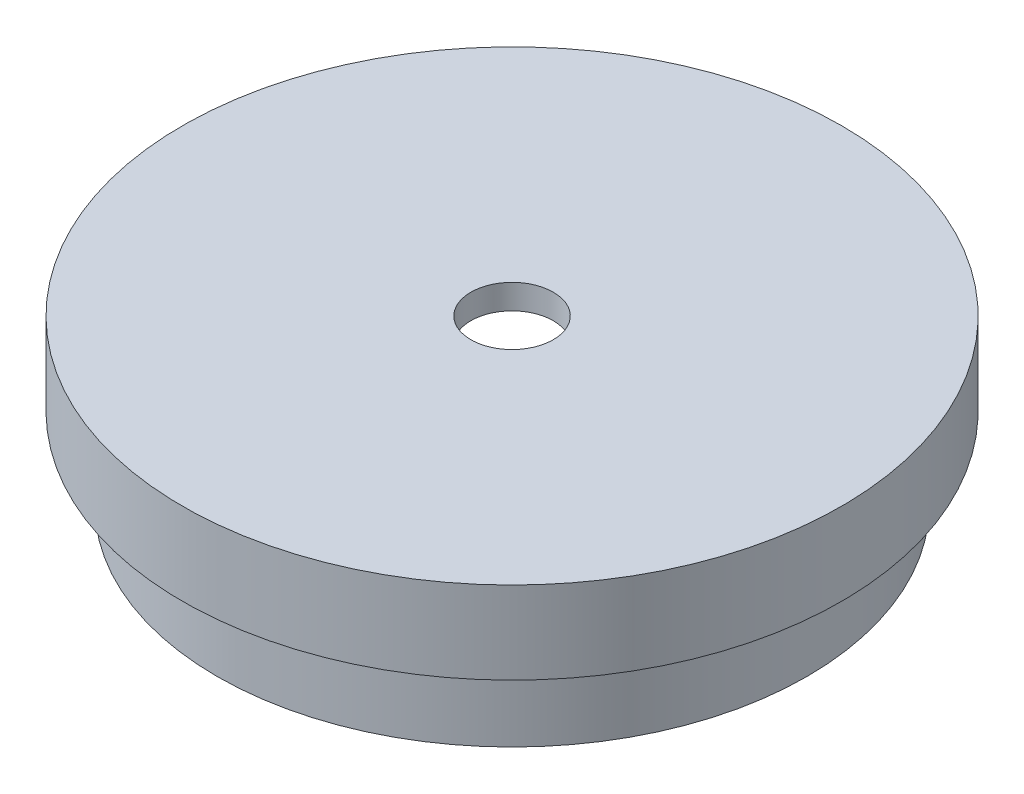
ISO-10303-21;
HEADER;
FILE_DESCRIPTION(('STEP AP214'),'2;1');
FILE_NAME('part.step','',(''),(''),'','','');
FILE_SCHEMA(('AUTOMOTIVE_DESIGN { 1 0 10303 214 1 1 1 1 }'));
ENDSEC;
DATA;
#1=APPLICATION_CONTEXT('core data for automotive mechanical design processes');
#2=APPLICATION_PROTOCOL_DEFINITION('international standard','automotive_design',2000,#1);
#3=PRODUCT_CONTEXT('',#1,'mechanical');
#4=PRODUCT('Part','Part','',(#3));
#5=PRODUCT_RELATED_PRODUCT_CATEGORY('part','',(#4));
#6=PRODUCT_DEFINITION_FORMATION('','',#4);
#7=PRODUCT_DEFINITION_CONTEXT('part definition',#1,'design');
#8=PRODUCT_DEFINITION('design','',#6,#7);
#9=PRODUCT_DEFINITION_SHAPE('','',#8);
#10=(LENGTH_UNIT() NAMED_UNIT(*) SI_UNIT(.MILLI.,.METRE.));
#11=(NAMED_UNIT(*) PLANE_ANGLE_UNIT() SI_UNIT($,.RADIAN.));
#12=(NAMED_UNIT(*) SI_UNIT($,.STERADIAN.) SOLID_ANGLE_UNIT());
#13=UNCERTAINTY_MEASURE_WITH_UNIT(LENGTH_MEASURE(1.E-05),#10,'distance_accuracy_value','');
#14=(GEOMETRIC_REPRESENTATION_CONTEXT(3) GLOBAL_UNCERTAINTY_ASSIGNED_CONTEXT((#13)) GLOBAL_UNIT_ASSIGNED_CONTEXT((#10,
#11,#12)) REPRESENTATION_CONTEXT('',''));
#15=CARTESIAN_POINT('',(0.,0.,0.));
#16=DIRECTION('',(0.,0.,1.));
#17=DIRECTION('',(1.,0.,0.));
#18=AXIS2_PLACEMENT_3D('',#15,#16,#17);
#19=CARTESIAN_POINT('',(16.4,0.,0.));
#20=DIRECTION('',(0.,-1.,0.));
#21=DIRECTION('',(0.,0.,-1.));
#22=AXIS2_PLACEMENT_3D('',#19,#20,#21);
#23=PLANE('',#22);
#24=CARTESIAN_POINT('',(0.,0.,0.));
#25=DIRECTION('',(0.,-1.,0.));
#26=DIRECTION('',(0.,0.,-1.));
#27=AXIS2_PLACEMENT_3D('',#24,#25,#26);
#28=CIRCLE('',#27,17.9);
#29=CARTESIAN_POINT('',(0.,0.,-17.9));
#30=VERTEX_POINT('',#29);
#31=EDGE_CURVE('E10',#30,#30,#28,.T.);
#32=ORIENTED_EDGE('',*,*,#31,.T.);
#33=EDGE_LOOP('',(#32));
#34=FACE_BOUND('',#33,.T.);
#35=CARTESIAN_POINT('',(0.,0.,0.));
#36=DIRECTION('',(0.,-1.,0.));
#37=DIRECTION('',(0.,0.,-1.));
#38=AXIS2_PLACEMENT_3D('',#35,#36,#37);
#39=CIRCLE('',#38,16.4);
#40=CARTESIAN_POINT('',(0.,0.,-16.4));
#41=VERTEX_POINT('',#40);
#42=EDGE_CURVE('E59',#41,#41,#39,.T.);
#43=ORIENTED_EDGE('',*,*,#42,.F.);
#44=EDGE_LOOP('',(#43));
#45=FACE_BOUND('',#44,.T.);
#46=ADVANCED_FACE('F31',(#34,#45),#23,.T.);
#47=CARTESIAN_POINT('',(0.,0.,0.));
#48=DIRECTION('',(0.,-1.,0.));
#49=DIRECTION('',(0.,0.,-1.));
#50=AXIS2_PLACEMENT_3D('',#47,#48,#49);
#51=CYLINDRICAL_SURFACE('',#50,17.9);
#52=CARTESIAN_POINT('',(0.,5.,0.));
#53=DIRECTION('',(0.,-1.,0.));
#54=DIRECTION('',(0.,0.,-1.));
#55=AXIS2_PLACEMENT_3D('',#52,#53,#54);
#56=CIRCLE('',#55,17.9);
#57=CARTESIAN_POINT('',(0.,5.,-17.9));
#58=VERTEX_POINT('',#57);
#59=EDGE_CURVE('E37',#58,#58,#56,.T.);
#60=ORIENTED_EDGE('',*,*,#59,.T.);
#61=EDGE_LOOP('',(#60));
#62=FACE_BOUND('',#61,.T.);
#63=ORIENTED_EDGE('',*,*,#31,.F.);
#64=EDGE_LOOP('',(#63));
#65=FACE_BOUND('',#64,.T.);
#66=ADVANCED_FACE('F67',(#62,#65),#51,.T.);
#67=CARTESIAN_POINT('',(17.9,5.,0.));
#68=DIRECTION('',(0.,-1.,0.));
#69=DIRECTION('',(0.,0.,-1.));
#70=AXIS2_PLACEMENT_3D('',#67,#68,#69);
#71=PLANE('',#70);
#72=CARTESIAN_POINT('',(0.,5.,0.));
#73=DIRECTION('',(0.,-1.,0.));
#74=DIRECTION('',(0.,0.,-1.));
#75=AXIS2_PLACEMENT_3D('',#72,#73,#74);
#76=CIRCLE('',#75,20.);
#77=CARTESIAN_POINT('',(0.,5.,-20.));
#78=VERTEX_POINT('',#77);
#79=EDGE_CURVE('E41',#78,#78,#76,.T.);
#80=ORIENTED_EDGE('',*,*,#79,.T.);
#81=EDGE_LOOP('',(#80));
#82=FACE_BOUND('',#81,.T.);
#83=ORIENTED_EDGE('',*,*,#59,.F.);
#84=EDGE_LOOP('',(#83));
#85=FACE_BOUND('',#84,.T.);
#86=ADVANCED_FACE('F71',(#82,#85),#71,.T.);
#87=CARTESIAN_POINT('',(0.,0.,0.));
#88=DIRECTION('',(0.,-1.,0.));
#89=DIRECTION('',(0.,0.,-1.));
#90=AXIS2_PLACEMENT_3D('',#87,#88,#89);
#91=CYLINDRICAL_SURFACE('',#90,20.);
#92=CARTESIAN_POINT('',(0.,10.,0.));
#93=DIRECTION('',(0.,-1.,0.));
#94=DIRECTION('',(0.,0.,-1.));
#95=AXIS2_PLACEMENT_3D('',#92,#93,#94);
#96=CIRCLE('',#95,20.);
#97=CARTESIAN_POINT('',(0.,10.,-20.));
#98=VERTEX_POINT('',#97);
#99=EDGE_CURVE('E45',#98,#98,#96,.T.);
#100=ORIENTED_EDGE('',*,*,#99,.T.);
#101=EDGE_LOOP('',(#100));
#102=FACE_BOUND('',#101,.T.);
#103=ORIENTED_EDGE('',*,*,#79,.F.);
#104=EDGE_LOOP('',(#103));
#105=FACE_BOUND('',#104,.T.);
#106=ADVANCED_FACE('F75',(#102,#105),#91,.T.);
#107=CARTESIAN_POINT('',(20.,10.,0.));
#108=DIRECTION('',(0.,1.,0.));
#109=DIRECTION('',(0.,0.,1.));
#110=AXIS2_PLACEMENT_3D('',#107,#108,#109);
#111=PLANE('',#110);
#112=CARTESIAN_POINT('',(0.,10.,0.));
#113=DIRECTION('',(0.,-1.,0.));
#114=DIRECTION('',(0.,0.,-1.));
#115=AXIS2_PLACEMENT_3D('',#112,#113,#114);
#116=CIRCLE('',#115,2.5);
#117=CARTESIAN_POINT('',(0.,10.,-2.5));
#118=VERTEX_POINT('',#117);
#119=EDGE_CURVE('E50',#118,#118,#116,.T.);
#120=ORIENTED_EDGE('',*,*,#119,.T.);
#121=EDGE_LOOP('',(#120));
#122=FACE_BOUND('',#121,.T.);
#123=ORIENTED_EDGE('',*,*,#99,.F.);
#124=EDGE_LOOP('',(#123));
#125=FACE_BOUND('',#124,.T.);
#126=ADVANCED_FACE('F82',(#122,#125),#111,.T.);
#127=CARTESIAN_POINT('',(0.,0.,0.));
#128=DIRECTION('',(0.,-1.,0.));
#129=DIRECTION('',(0.,0.,-1.));
#130=AXIS2_PLACEMENT_3D('',#127,#128,#129);
#131=CYLINDRICAL_SURFACE('',#130,2.5);
#132=CARTESIAN_POINT('',(0.,8.5,0.));
#133=DIRECTION('',(0.,-1.,0.));
#134=DIRECTION('',(0.,0.,-1.));
#135=AXIS2_PLACEMENT_3D('',#132,#133,#134);
#136=CIRCLE('',#135,2.5);
#137=CARTESIAN_POINT('',(0.,8.5,-2.5));
#138=VERTEX_POINT('',#137);
#139=EDGE_CURVE('E53',#138,#138,#136,.T.);
#140=ORIENTED_EDGE('',*,*,#139,.T.);
#141=EDGE_LOOP('',(#140));
#142=FACE_BOUND('',#141,.T.);
#143=ORIENTED_EDGE('',*,*,#119,.F.);
#144=EDGE_LOOP('',(#143));
#145=FACE_BOUND('',#144,.T.);
#146=ADVANCED_FACE('F86',(#142,#145),#131,.F.);
#147=CARTESIAN_POINT('',(2.5,8.5,0.));
#148=DIRECTION('',(0.,-1.,0.));
#149=DIRECTION('',(0.,0.,-1.));
#150=AXIS2_PLACEMENT_3D('',#147,#148,#149);
#151=PLANE('',#150);
#152=CARTESIAN_POINT('',(0.,8.5,0.));
#153=DIRECTION('',(0.,-1.,0.));
#154=DIRECTION('',(0.,0.,-1.));
#155=AXIS2_PLACEMENT_3D('',#152,#153,#154);
#156=CIRCLE('',#155,16.4);
#157=CARTESIAN_POINT('',(0.,8.5,-16.4));
#158=VERTEX_POINT('',#157);
#159=EDGE_CURVE('E56',#158,#158,#156,.T.);
#160=ORIENTED_EDGE('',*,*,#159,.T.);
#161=EDGE_LOOP('',(#160));
#162=FACE_BOUND('',#161,.T.);
#163=ORIENTED_EDGE('',*,*,#139,.F.);
#164=EDGE_LOOP('',(#163));
#165=FACE_BOUND('',#164,.T.);
#166=ADVANCED_FACE('F90',(#162,#165),#151,.T.);
#167=CARTESIAN_POINT('',(0.,0.,0.));
#168=DIRECTION('',(0.,-1.,0.));
#169=DIRECTION('',(0.,0.,-1.));
#170=AXIS2_PLACEMENT_3D('',#167,#168,#169);
#171=CYLINDRICAL_SURFACE('',#170,16.4);
#172=ORIENTED_EDGE('',*,*,#42,.T.);
#173=EDGE_LOOP('',(#172));
#174=FACE_BOUND('',#173,.T.);
#175=ORIENTED_EDGE('',*,*,#159,.F.);
#176=EDGE_LOOP('',(#175));
#177=FACE_BOUND('',#176,.T.);
#178=ADVANCED_FACE('F63',(#174,#177),#171,.F.);
#179=CLOSED_SHELL('',(#46,#66,#86,#106,#126,#146,#166,#178));
#180=MANIFOLD_SOLID_BREP('B2',#179);
#181=ADVANCED_BREP_SHAPE_REPRESENTATION('',(#18,#180),#14);
#182=SHAPE_DEFINITION_REPRESENTATION(#9,#181);
ENDSEC;
END-ISO-10303-21;
